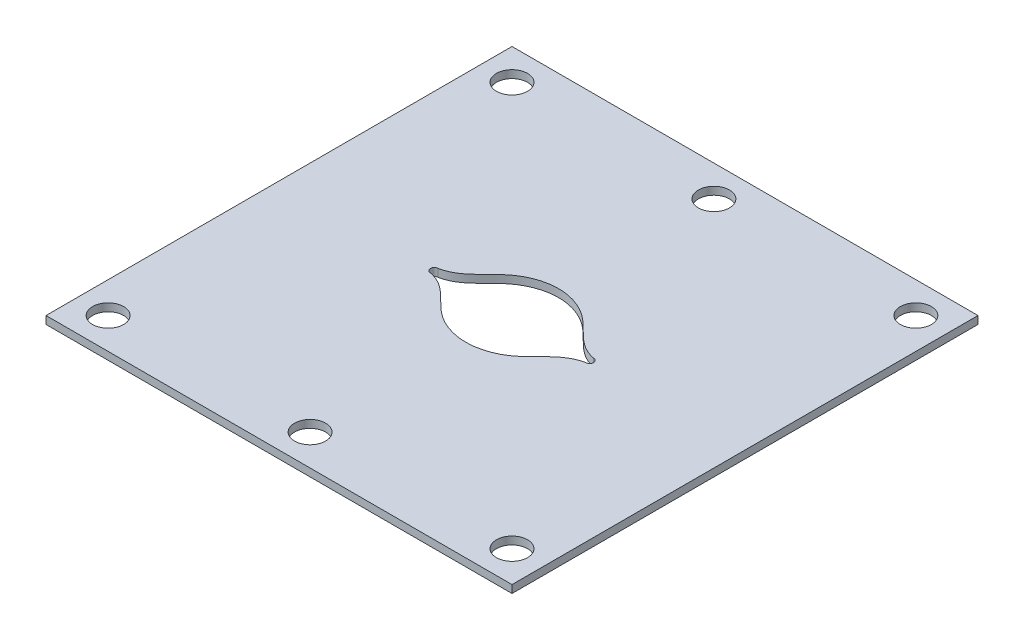
ISO-10303-21;
HEADER;
FILE_DESCRIPTION(('STEP AP214'),'2;1');
FILE_NAME('part.step','',(''),(''),'','','');
FILE_SCHEMA(('AUTOMOTIVE_DESIGN { 1 0 10303 214 1 1 1 1 }'));
ENDSEC;
DATA;
#1=APPLICATION_CONTEXT('core data for automotive mechanical design processes');
#2=APPLICATION_PROTOCOL_DEFINITION('international standard','automotive_design',2000,#1);
#3=PRODUCT_CONTEXT('',#1,'mechanical');
#4=PRODUCT('Part','Part','',(#3));
#5=PRODUCT_RELATED_PRODUCT_CATEGORY('part','',(#4));
#6=PRODUCT_DEFINITION_FORMATION('','',#4);
#7=PRODUCT_DEFINITION_CONTEXT('part definition',#1,'design');
#8=PRODUCT_DEFINITION('design','',#6,#7);
#9=PRODUCT_DEFINITION_SHAPE('','',#8);
#10=(LENGTH_UNIT() NAMED_UNIT(*) SI_UNIT(.MILLI.,.METRE.));
#11=(NAMED_UNIT(*) PLANE_ANGLE_UNIT() SI_UNIT($,.RADIAN.));
#12=(NAMED_UNIT(*) SI_UNIT($,.STERADIAN.) SOLID_ANGLE_UNIT());
#13=UNCERTAINTY_MEASURE_WITH_UNIT(LENGTH_MEASURE(1.E-05),#10,'distance_accuracy_value','');
#14=(GEOMETRIC_REPRESENTATION_CONTEXT(3) GLOBAL_UNCERTAINTY_ASSIGNED_CONTEXT((#13)) GLOBAL_UNIT_ASSIGNED_CONTEXT((#10,
#11,#12)) REPRESENTATION_CONTEXT('',''));
#15=CARTESIAN_POINT('',(0.,0.,0.));
#16=DIRECTION('',(0.,0.,1.));
#17=DIRECTION('',(1.,0.,0.));
#18=AXIS2_PLACEMENT_3D('',#15,#16,#17);
#19=CARTESIAN_POINT('',(-30.,1.,30.));
#20=DIRECTION('',(1.,0.,0.));
#21=DIRECTION('',(0.,0.,-1.));
#22=AXIS2_PLACEMENT_3D('',#19,#20,#21);
#23=PLANE('',#22);
#24=DIRECTION('',(0.,0.,1.));
#25=VECTOR('',#24,1.);
#26=CARTESIAN_POINT('',(-30.,0.,30.));
#27=LINE('',#26,#25);
#28=CARTESIAN_POINT('',(-30.,0.,-30.));
#29=VERTEX_POINT('',#28);
#30=CARTESIAN_POINT('',(-30.,0.,30.));
#31=VERTEX_POINT('',#30);
#32=EDGE_CURVE('E189',#29,#31,#27,.T.);
#33=ORIENTED_EDGE('',*,*,#32,.T.);
#34=DIRECTION('',(0.,-1.,0.));
#35=VECTOR('',#34,1.);
#36=CARTESIAN_POINT('',(-30.,1.,30.));
#37=LINE('',#36,#35);
#38=CARTESIAN_POINT('',(-30.,1.,30.));
#39=VERTEX_POINT('',#38);
#40=EDGE_CURVE('E218',#39,#31,#37,.T.);
#41=ORIENTED_EDGE('',*,*,#40,.F.);
#42=DIRECTION('',(0.,0.,1.));
#43=VECTOR('',#42,1.);
#44=CARTESIAN_POINT('',(-30.,1.,30.));
#45=LINE('',#44,#43);
#46=CARTESIAN_POINT('',(-30.,1.,-30.));
#47=VERTEX_POINT('',#46);
#48=EDGE_CURVE('E192',#47,#39,#45,.T.);
#49=ORIENTED_EDGE('',*,*,#48,.F.);
#50=DIRECTION('',(0.,-1.,0.));
#51=VECTOR('',#50,1.);
#52=CARTESIAN_POINT('',(-30.,1.,-30.));
#53=LINE('',#52,#51);
#54=EDGE_CURVE('E202',#47,#29,#53,.T.);
#55=ORIENTED_EDGE('',*,*,#54,.T.);
#56=EDGE_LOOP('',(#33,#41,#49,#55));
#57=FACE_BOUND('',#56,.T.);
#58=ADVANCED_FACE('F34',(#57),#23,.F.);
#59=CARTESIAN_POINT('',(30.,1.,30.));
#60=DIRECTION('',(0.,0.,-1.));
#61=DIRECTION('',(-1.,0.,0.));
#62=AXIS2_PLACEMENT_3D('',#59,#60,#61);
#63=PLANE('',#62);
#64=DIRECTION('',(1.,0.,0.));
#65=VECTOR('',#64,1.);
#66=CARTESIAN_POINT('',(30.,0.,30.));
#67=LINE('',#66,#65);
#68=CARTESIAN_POINT('',(30.,0.,30.));
#69=VERTEX_POINT('',#68);
#70=EDGE_CURVE('E205',#31,#69,#67,.T.);
#71=ORIENTED_EDGE('',*,*,#70,.T.);
#72=DIRECTION('',(0.,-1.,0.));
#73=VECTOR('',#72,1.);
#74=CARTESIAN_POINT('',(30.,1.,30.));
#75=LINE('',#74,#73);
#76=CARTESIAN_POINT('',(30.,1.,30.));
#77=VERTEX_POINT('',#76);
#78=EDGE_CURVE('E215',#77,#69,#75,.T.);
#79=ORIENTED_EDGE('',*,*,#78,.F.);
#80=DIRECTION('',(1.,0.,0.));
#81=VECTOR('',#80,1.);
#82=CARTESIAN_POINT('',(30.,1.,30.));
#83=LINE('',#82,#81);
#84=EDGE_CURVE('E195',#39,#77,#83,.T.);
#85=ORIENTED_EDGE('',*,*,#84,.F.);
#86=ORIENTED_EDGE('',*,*,#40,.T.);
#87=EDGE_LOOP('',(#71,#79,#85,#86));
#88=FACE_BOUND('',#87,.T.);
#89=ADVANCED_FACE('F234',(#88),#63,.F.);
#90=CARTESIAN_POINT('',(30.,1.,30.));
#91=DIRECTION('',(-1.,0.,0.));
#92=DIRECTION('',(0.,0.,1.));
#93=AXIS2_PLACEMENT_3D('',#90,#91,#92);
#94=PLANE('',#93);
#95=DIRECTION('',(0.,0.,-1.));
#96=VECTOR('',#95,1.);
#97=CARTESIAN_POINT('',(30.,0.,30.));
#98=LINE('',#97,#96);
#99=CARTESIAN_POINT('',(30.,0.,-30.));
#100=VERTEX_POINT('',#99);
#101=EDGE_CURVE('E207',#69,#100,#98,.T.);
#102=ORIENTED_EDGE('',*,*,#101,.T.);
#103=DIRECTION('',(0.,-1.,0.));
#104=VECTOR('',#103,1.);
#105=CARTESIAN_POINT('',(30.,1.,-30.));
#106=LINE('',#105,#104);
#107=CARTESIAN_POINT('',(30.,1.,-30.));
#108=VERTEX_POINT('',#107);
#109=EDGE_CURVE('E212',#108,#100,#106,.T.);
#110=ORIENTED_EDGE('',*,*,#109,.F.);
#111=DIRECTION('',(0.,0.,-1.));
#112=VECTOR('',#111,1.);
#113=CARTESIAN_POINT('',(30.,1.,30.));
#114=LINE('',#113,#112);
#115=EDGE_CURVE('E198',#77,#108,#114,.T.);
#116=ORIENTED_EDGE('',*,*,#115,.F.);
#117=ORIENTED_EDGE('',*,*,#78,.T.);
#118=EDGE_LOOP('',(#102,#110,#116,#117));
#119=FACE_BOUND('',#118,.T.);
#120=ADVANCED_FACE('F239',(#119),#94,.F.);
#121=CARTESIAN_POINT('',(30.,1.,-30.));
#122=DIRECTION('',(0.,0.,1.));
#123=DIRECTION('',(1.,0.,0.));
#124=AXIS2_PLACEMENT_3D('',#121,#122,#123);
#125=PLANE('',#124);
#126=DIRECTION('',(-1.,0.,0.));
#127=VECTOR('',#126,1.);
#128=CARTESIAN_POINT('',(30.,0.,-30.));
#129=LINE('',#128,#127);
#130=EDGE_CURVE('E196',#100,#29,#129,.T.);
#131=ORIENTED_EDGE('',*,*,#130,.T.);
#132=ORIENTED_EDGE('',*,*,#54,.F.);
#133=DIRECTION('',(-1.,0.,0.));
#134=VECTOR('',#133,1.);
#135=CARTESIAN_POINT('',(30.,1.,-30.));
#136=LINE('',#135,#134);
#137=EDGE_CURVE('E200',#108,#47,#136,.T.);
#138=ORIENTED_EDGE('',*,*,#137,.F.);
#139=ORIENTED_EDGE('',*,*,#109,.T.);
#140=EDGE_LOOP('',(#131,#132,#138,#139));
#141=FACE_BOUND('',#140,.T.);
#142=ADVANCED_FACE('F254',(#141),#125,.F.);
#143=CARTESIAN_POINT('',(0.,1.,0.));
#144=DIRECTION('',(0.,1.,0.));
#145=DIRECTION('',(0.,0.,1.));
#146=AXIS2_PLACEMENT_3D('',#143,#144,#145);
#147=PLANE('',#146);
#148=CARTESIAN_POINT('',(-10.,1.,0.5));
#149=CARTESIAN_POINT('',(-7.53961415841813,1.,0.960866700631798));
#150=CARTESIAN_POINT('',(-5.55145115373581,1.,4.66287064469579));
#151=CARTESIAN_POINT('',(0.,1.,6.48271716056343));
#152=CARTESIAN_POINT('',(5.55145115373581,1.,4.66287064469579));
#153=CARTESIAN_POINT('',(7.53961415841813,1.,0.960866700631792));
#154=CARTESIAN_POINT('',(10.,1.,0.500000000000001));
#155=B_SPLINE_CURVE_WITH_KNOTS('',3,(#148,#149,#150,#151,#152,#153,#154),.UNSPECIFIED.,.F.,.F.,
(4,1,1,1,4),(0.,0.296041392949198,0.5,0.703958607050802,1.),.UNSPECIFIED.);
#156=CARTESIAN_POINT('',(-10.,1.,0.500000000000001));
#157=VERTEX_POINT('',#156);
#158=CARTESIAN_POINT('',(10.,1.,0.500000000000001));
#159=VERTEX_POINT('',#158);
#160=EDGE_CURVE('E114',#157,#159,#155,.T.);
#161=ORIENTED_EDGE('',*,*,#160,.F.);
#162=CARTESIAN_POINT('',(-10.,1.,0.));
#163=DIRECTION('',(0.,1.,0.));
#164=DIRECTION('',(0.,0.,1.));
#165=AXIS2_PLACEMENT_3D('',#162,#163,#164);
#166=CIRCLE('',#165,0.500000000000001);
#167=CARTESIAN_POINT('',(-10.,1.,-0.500000000000001));
#168=VERTEX_POINT('',#167);
#169=EDGE_CURVE('E119',#168,#157,#166,.T.);
#170=ORIENTED_EDGE('',*,*,#169,.F.);
#171=CARTESIAN_POINT('',(10.,1.,-0.500000000000001));
#172=CARTESIAN_POINT('',(7.5418560903601,1.,-0.971550621999899));
#173=CARTESIAN_POINT('',(5.54199885024011,1.,-4.63362119343008));
#174=CARTESIAN_POINT('',(0.,1.,-6.55833807754496));
#175=CARTESIAN_POINT('',(-5.5419988502401,1.,-4.63362119343008));
#176=CARTESIAN_POINT('',(-7.5418560903601,1.,-0.971550621999899));
#177=CARTESIAN_POINT('',(-10.,1.,-0.5));
#178=B_SPLINE_CURVE_WITH_KNOTS('',3,(#171,#172,#173,#174,#175,#176,#177),.UNSPECIFIED.,.F.,.F.,
(4,1,1,1,4),(0.,0.295686937304533,0.5,0.704313062695467,1.),.UNSPECIFIED.);
#179=CARTESIAN_POINT('',(10.,1.,-0.500000000000001));
#180=VERTEX_POINT('',#179);
#181=EDGE_CURVE('E48',#180,#168,#178,.T.);
#182=ORIENTED_EDGE('',*,*,#181,.F.);
#183=CARTESIAN_POINT('',(10.,1.,0.));
#184=DIRECTION('',(0.,1.,0.));
#185=DIRECTION('',(0.,0.,1.));
#186=AXIS2_PLACEMENT_3D('',#183,#184,#185);
#187=CIRCLE('',#186,0.500000000000001);
#188=EDGE_CURVE('E102',#159,#180,#187,.T.);
#189=ORIENTED_EDGE('',*,*,#188,.F.);
#190=EDGE_LOOP('',(#161,#170,#182,#189));
#191=FACE_BOUND('',#190,.T.);
#192=CARTESIAN_POINT('',(-26.,1.,26.));
#193=DIRECTION('',(0.,1.,0.));
#194=DIRECTION('',(0.,0.,1.));
#195=AXIS2_PLACEMENT_3D('',#192,#193,#194);
#196=CIRCLE('',#195,2.);
#197=CARTESIAN_POINT('',(-26.,1.,28.));
#198=VERTEX_POINT('',#197);
#199=EDGE_CURVE('E154',#198,#198,#196,.T.);
#200=ORIENTED_EDGE('',*,*,#199,.F.);
#201=EDGE_LOOP('',(#200));
#202=FACE_BOUND('',#201,.T.);
#203=CARTESIAN_POINT('',(0.,1.,26.));
#204=DIRECTION('',(0.,1.,0.));
#205=DIRECTION('',(0.,0.,1.));
#206=AXIS2_PLACEMENT_3D('',#203,#204,#205);
#207=CIRCLE('',#206,2.);
#208=CARTESIAN_POINT('',(0.,1.,28.));
#209=VERTEX_POINT('',#208);
#210=EDGE_CURVE('E159',#209,#209,#207,.T.);
#211=ORIENTED_EDGE('',*,*,#210,.F.);
#212=EDGE_LOOP('',(#211));
#213=FACE_BOUND('',#212,.T.);
#214=CARTESIAN_POINT('',(26.,1.,26.));
#215=DIRECTION('',(0.,1.,0.));
#216=DIRECTION('',(0.,0.,1.));
#217=AXIS2_PLACEMENT_3D('',#214,#215,#216);
#218=CIRCLE('',#217,2.);
#219=CARTESIAN_POINT('',(26.,1.,28.));
#220=VERTEX_POINT('',#219);
#221=EDGE_CURVE('E165',#220,#220,#218,.T.);
#222=ORIENTED_EDGE('',*,*,#221,.F.);
#223=EDGE_LOOP('',(#222));
#224=FACE_BOUND('',#223,.T.);
#225=CARTESIAN_POINT('',(26.,1.,-26.));
#226=DIRECTION('',(0.,1.,0.));
#227=DIRECTION('',(0.,0.,1.));
#228=AXIS2_PLACEMENT_3D('',#225,#226,#227);
#229=CIRCLE('',#228,2.);
#230=CARTESIAN_POINT('',(26.,1.,-24.));
#231=VERTEX_POINT('',#230);
#232=EDGE_CURVE('E171',#231,#231,#229,.T.);
#233=ORIENTED_EDGE('',*,*,#232,.F.);
#234=EDGE_LOOP('',(#233));
#235=FACE_BOUND('',#234,.T.);
#236=CARTESIAN_POINT('',(0.,1.,-26.));
#237=DIRECTION('',(0.,1.,0.));
#238=DIRECTION('',(0.,0.,1.));
#239=AXIS2_PLACEMENT_3D('',#236,#237,#238);
#240=CIRCLE('',#239,2.);
#241=CARTESIAN_POINT('',(0.,1.,-24.));
#242=VERTEX_POINT('',#241);
#243=EDGE_CURVE('E177',#242,#242,#240,.T.);
#244=ORIENTED_EDGE('',*,*,#243,.F.);
#245=EDGE_LOOP('',(#244));
#246=FACE_BOUND('',#245,.T.);
#247=CARTESIAN_POINT('',(-26.,1.,-26.));
#248=DIRECTION('',(0.,1.,0.));
#249=DIRECTION('',(0.,0.,1.));
#250=AXIS2_PLACEMENT_3D('',#247,#248,#249);
#251=CIRCLE('',#250,2.);
#252=CARTESIAN_POINT('',(-26.,1.,-24.));
#253=VERTEX_POINT('',#252);
#254=EDGE_CURVE('E183',#253,#253,#251,.T.);
#255=ORIENTED_EDGE('',*,*,#254,.F.);
#256=EDGE_LOOP('',(#255));
#257=FACE_BOUND('',#256,.T.);
#258=ORIENTED_EDGE('',*,*,#48,.T.);
#259=ORIENTED_EDGE('',*,*,#84,.T.);
#260=ORIENTED_EDGE('',*,*,#115,.T.);
#261=ORIENTED_EDGE('',*,*,#137,.T.);
#262=EDGE_LOOP('',(#258,#259,#260,#261));
#263=FACE_BOUND('',#262,.T.);
#264=ADVANCED_FACE('F117',(#191,#202,#213,#224,#235,#246,#257,#263),#147,.T.);
#265=CARTESIAN_POINT('',(0.,0.,0.));
#266=DIRECTION('',(0.,1.,0.));
#267=DIRECTION('',(0.,0.,1.));
#268=AXIS2_PLACEMENT_3D('',#265,#266,#267);
#269=PLANE('',#268);
#270=CARTESIAN_POINT('',(-10.,0.,0.));
#271=DIRECTION('',(0.,1.,0.));
#272=DIRECTION('',(0.,0.,1.));
#273=AXIS2_PLACEMENT_3D('',#270,#271,#272);
#274=CIRCLE('',#273,0.500000000000001);
#275=CARTESIAN_POINT('',(-10.,0.,-0.5));
#276=VERTEX_POINT('',#275);
#277=CARTESIAN_POINT('',(-10.,0.,0.500000000000001));
#278=VERTEX_POINT('',#277);
#279=EDGE_CURVE('E56',#276,#278,#274,.T.);
#280=ORIENTED_EDGE('',*,*,#279,.T.);
#281=CARTESIAN_POINT('',(-10.,0.,0.5));
#282=CARTESIAN_POINT('',(-7.53961415841813,0.,0.960866700631798));
#283=CARTESIAN_POINT('',(-5.55145115373581,0.,4.66287064469579));
#284=CARTESIAN_POINT('',(0.,0.,6.48271716056343));
#285=CARTESIAN_POINT('',(5.55145115373581,0.,4.66287064469579));
#286=CARTESIAN_POINT('',(7.53961415841813,0.,0.960866700631792));
#287=CARTESIAN_POINT('',(10.,0.,0.500000000000001));
#288=B_SPLINE_CURVE_WITH_KNOTS('',3,(#281,#282,#283,#284,#285,#286,#287),.UNSPECIFIED.,.F.,.F.,
(4,1,1,1,4),(0.,0.296041392949198,0.5,0.703958607050802,1.),.UNSPECIFIED.);
#289=CARTESIAN_POINT('',(10.,0.,0.500000000000001));
#290=VERTEX_POINT('',#289);
#291=EDGE_CURVE('E142',#278,#290,#288,.T.);
#292=ORIENTED_EDGE('',*,*,#291,.T.);
#293=CARTESIAN_POINT('',(10.,0.,0.));
#294=DIRECTION('',(0.,1.,0.));
#295=DIRECTION('',(0.,0.,1.));
#296=AXIS2_PLACEMENT_3D('',#293,#294,#295);
#297=CIRCLE('',#296,0.500000000000001);
#298=CARTESIAN_POINT('',(10.,0.,-0.500000000000001));
#299=VERTEX_POINT('',#298);
#300=EDGE_CURVE('E109',#290,#299,#297,.T.);
#301=ORIENTED_EDGE('',*,*,#300,.T.);
#302=CARTESIAN_POINT('',(10.,0.,-0.500000000000001));
#303=CARTESIAN_POINT('',(7.5418560903601,0.,-0.971550621999899));
#304=CARTESIAN_POINT('',(5.54199885024011,0.,-4.63362119343008));
#305=CARTESIAN_POINT('',(0.,0.,-6.55833807754496));
#306=CARTESIAN_POINT('',(-5.5419988502401,0.,-4.63362119343008));
#307=CARTESIAN_POINT('',(-7.5418560903601,0.,-0.971550621999899));
#308=CARTESIAN_POINT('',(-10.,0.,-0.5));
#309=B_SPLINE_CURVE_WITH_KNOTS('',3,(#302,#303,#304,#305,#306,#307,#308),.UNSPECIFIED.,.F.,.F.,
(4,1,1,1,4),(0.,0.295686937304533,0.5,0.704313062695467,1.),.UNSPECIFIED.);
#310=EDGE_CURVE('E113',#299,#276,#309,.T.);
#311=ORIENTED_EDGE('',*,*,#310,.T.);
#312=EDGE_LOOP('',(#280,#292,#301,#311));
#313=FACE_BOUND('',#312,.T.);
#314=CARTESIAN_POINT('',(-26.,0.,26.));
#315=DIRECTION('',(0.,1.,0.));
#316=DIRECTION('',(0.,0.,1.));
#317=AXIS2_PLACEMENT_3D('',#314,#315,#316);
#318=CIRCLE('',#317,2.);
#319=CARTESIAN_POINT('',(-26.,0.,28.));
#320=VERTEX_POINT('',#319);
#321=EDGE_CURVE('E156',#320,#320,#318,.T.);
#322=ORIENTED_EDGE('',*,*,#321,.T.);
#323=EDGE_LOOP('',(#322));
#324=FACE_BOUND('',#323,.T.);
#325=CARTESIAN_POINT('',(0.,0.,26.));
#326=DIRECTION('',(0.,1.,0.));
#327=DIRECTION('',(0.,0.,1.));
#328=AXIS2_PLACEMENT_3D('',#325,#326,#327);
#329=CIRCLE('',#328,2.);
#330=CARTESIAN_POINT('',(0.,0.,28.));
#331=VERTEX_POINT('',#330);
#332=EDGE_CURVE('E162',#331,#331,#329,.T.);
#333=ORIENTED_EDGE('',*,*,#332,.T.);
#334=EDGE_LOOP('',(#333));
#335=FACE_BOUND('',#334,.T.);
#336=CARTESIAN_POINT('',(26.,0.,26.));
#337=DIRECTION('',(0.,1.,0.));
#338=DIRECTION('',(0.,0.,1.));
#339=AXIS2_PLACEMENT_3D('',#336,#337,#338);
#340=CIRCLE('',#339,2.);
#341=CARTESIAN_POINT('',(26.,0.,28.));
#342=VERTEX_POINT('',#341);
#343=EDGE_CURVE('E168',#342,#342,#340,.T.);
#344=ORIENTED_EDGE('',*,*,#343,.T.);
#345=EDGE_LOOP('',(#344));
#346=FACE_BOUND('',#345,.T.);
#347=CARTESIAN_POINT('',(26.,0.,-26.));
#348=DIRECTION('',(0.,1.,0.));
#349=DIRECTION('',(0.,0.,1.));
#350=AXIS2_PLACEMENT_3D('',#347,#348,#349);
#351=CIRCLE('',#350,2.);
#352=CARTESIAN_POINT('',(26.,0.,-24.));
#353=VERTEX_POINT('',#352);
#354=EDGE_CURVE('E174',#353,#353,#351,.T.);
#355=ORIENTED_EDGE('',*,*,#354,.T.);
#356=EDGE_LOOP('',(#355));
#357=FACE_BOUND('',#356,.T.);
#358=CARTESIAN_POINT('',(0.,0.,-26.));
#359=DIRECTION('',(0.,1.,0.));
#360=DIRECTION('',(0.,0.,1.));
#361=AXIS2_PLACEMENT_3D('',#358,#359,#360);
#362=CIRCLE('',#361,2.);
#363=CARTESIAN_POINT('',(0.,0.,-24.));
#364=VERTEX_POINT('',#363);
#365=EDGE_CURVE('E180',#364,#364,#362,.T.);
#366=ORIENTED_EDGE('',*,*,#365,.T.);
#367=EDGE_LOOP('',(#366));
#368=FACE_BOUND('',#367,.T.);
#369=CARTESIAN_POINT('',(-26.,0.,-26.));
#370=DIRECTION('',(0.,1.,0.));
#371=DIRECTION('',(0.,0.,1.));
#372=AXIS2_PLACEMENT_3D('',#369,#370,#371);
#373=CIRCLE('',#372,2.);
#374=CARTESIAN_POINT('',(-26.,0.,-24.));
#375=VERTEX_POINT('',#374);
#376=EDGE_CURVE('E186',#375,#375,#373,.T.);
#377=ORIENTED_EDGE('',*,*,#376,.T.);
#378=EDGE_LOOP('',(#377));
#379=FACE_BOUND('',#378,.T.);
#380=ORIENTED_EDGE('',*,*,#32,.F.);
#381=ORIENTED_EDGE('',*,*,#130,.F.);
#382=ORIENTED_EDGE('',*,*,#101,.F.);
#383=ORIENTED_EDGE('',*,*,#70,.F.);
#384=EDGE_LOOP('',(#380,#381,#382,#383));
#385=FACE_BOUND('',#384,.T.);
#386=ADVANCED_FACE('F223',(#313,#324,#335,#346,#357,#368,#379,#385),#269,.F.);
#387=CARTESIAN_POINT('',(-26.,0.,-26.));
#388=DIRECTION('',(0.,1.,0.));
#389=DIRECTION('',(0.,0.,1.));
#390=AXIS2_PLACEMENT_3D('',#387,#388,#389);
#391=CYLINDRICAL_SURFACE('',#390,2.);
#392=ORIENTED_EDGE('',*,*,#376,.F.);
#393=EDGE_LOOP('',(#392));
#394=FACE_BOUND('',#393,.T.);
#395=ORIENTED_EDGE('',*,*,#254,.T.);
#396=EDGE_LOOP('',(#395));
#397=FACE_BOUND('',#396,.T.);
#398=ADVANCED_FACE('F265',(#394,#397),#391,.F.);
#399=CARTESIAN_POINT('',(0.,0.,-26.));
#400=DIRECTION('',(0.,1.,0.));
#401=DIRECTION('',(0.,0.,1.));
#402=AXIS2_PLACEMENT_3D('',#399,#400,#401);
#403=CYLINDRICAL_SURFACE('',#402,2.);
#404=ORIENTED_EDGE('',*,*,#365,.F.);
#405=EDGE_LOOP('',(#404));
#406=FACE_BOUND('',#405,.T.);
#407=ORIENTED_EDGE('',*,*,#243,.T.);
#408=EDGE_LOOP('',(#407));
#409=FACE_BOUND('',#408,.T.);
#410=ADVANCED_FACE('F270',(#406,#409),#403,.F.);
#411=CARTESIAN_POINT('',(26.,0.,-26.));
#412=DIRECTION('',(0.,1.,0.));
#413=DIRECTION('',(0.,0.,1.));
#414=AXIS2_PLACEMENT_3D('',#411,#412,#413);
#415=CYLINDRICAL_SURFACE('',#414,2.);
#416=ORIENTED_EDGE('',*,*,#354,.F.);
#417=EDGE_LOOP('',(#416));
#418=FACE_BOUND('',#417,.T.);
#419=ORIENTED_EDGE('',*,*,#232,.T.);
#420=EDGE_LOOP('',(#419));
#421=FACE_BOUND('',#420,.T.);
#422=ADVANCED_FACE('F274',(#418,#421),#415,.F.);
#423=CARTESIAN_POINT('',(26.,0.,26.));
#424=DIRECTION('',(0.,1.,0.));
#425=DIRECTION('',(0.,0.,1.));
#426=AXIS2_PLACEMENT_3D('',#423,#424,#425);
#427=CYLINDRICAL_SURFACE('',#426,2.);
#428=ORIENTED_EDGE('',*,*,#343,.F.);
#429=EDGE_LOOP('',(#428));
#430=FACE_BOUND('',#429,.T.);
#431=ORIENTED_EDGE('',*,*,#221,.T.);
#432=EDGE_LOOP('',(#431));
#433=FACE_BOUND('',#432,.T.);
#434=ADVANCED_FACE('F278',(#430,#433),#427,.F.);
#435=CARTESIAN_POINT('',(0.,0.,26.));
#436=DIRECTION('',(0.,1.,0.));
#437=DIRECTION('',(0.,0.,1.));
#438=AXIS2_PLACEMENT_3D('',#435,#436,#437);
#439=CYLINDRICAL_SURFACE('',#438,2.);
#440=ORIENTED_EDGE('',*,*,#332,.F.);
#441=EDGE_LOOP('',(#440));
#442=FACE_BOUND('',#441,.T.);
#443=ORIENTED_EDGE('',*,*,#210,.T.);
#444=EDGE_LOOP('',(#443));
#445=FACE_BOUND('',#444,.T.);
#446=ADVANCED_FACE('F282',(#442,#445),#439,.F.);
#447=CARTESIAN_POINT('',(-26.,0.,26.));
#448=DIRECTION('',(0.,1.,0.));
#449=DIRECTION('',(0.,0.,1.));
#450=AXIS2_PLACEMENT_3D('',#447,#448,#449);
#451=CYLINDRICAL_SURFACE('',#450,2.);
#452=ORIENTED_EDGE('',*,*,#321,.F.);
#453=EDGE_LOOP('',(#452));
#454=FACE_BOUND('',#453,.T.);
#455=ORIENTED_EDGE('',*,*,#199,.T.);
#456=EDGE_LOOP('',(#455));
#457=FACE_BOUND('',#456,.T.);
#458=ADVANCED_FACE('F286',(#454,#457),#451,.F.);
#459=CARTESIAN_POINT('',(10.,0.,0.));
#460=DIRECTION('',(0.,1.,0.));
#461=DIRECTION('',(0.,0.,1.));
#462=AXIS2_PLACEMENT_3D('',#459,#460,#461);
#463=CYLINDRICAL_SURFACE('',#462,0.500000000000001);
#464=DIRECTION('',(0.,1.,0.));
#465=VECTOR('',#464,1.);
#466=CARTESIAN_POINT('',(10.,-9.,-0.500000000000001));
#467=LINE('',#466,#465);
#468=EDGE_CURVE('E105',#299,#180,#467,.T.);
#469=ORIENTED_EDGE('',*,*,#468,.F.);
#470=ORIENTED_EDGE('',*,*,#300,.F.);
#471=DIRECTION('',(0.,1.,0.));
#472=VECTOR('',#471,1.);
#473=CARTESIAN_POINT('',(10.,-9.,0.500000000000001));
#474=LINE('',#473,#472);
#475=EDGE_CURVE('E106',#290,#159,#474,.T.);
#476=ORIENTED_EDGE('',*,*,#475,.T.);
#477=ORIENTED_EDGE('',*,*,#188,.T.);
#478=EDGE_LOOP('',(#469,#470,#476,#477));
#479=FACE_BOUND('',#478,.T.);
#480=ADVANCED_FACE('F103',(#479),#463,.F.);
#481=CARTESIAN_POINT('',(-10.,0.,0.));
#482=DIRECTION('',(0.,1.,0.));
#483=DIRECTION('',(0.,0.,1.));
#484=AXIS2_PLACEMENT_3D('',#481,#482,#483);
#485=CYLINDRICAL_SURFACE('',#484,0.500000000000001);
#486=DIRECTION('',(0.,1.,0.));
#487=VECTOR('',#486,1.);
#488=CARTESIAN_POINT('',(-10.,-9.,0.500000000000001));
#489=LINE('',#488,#487);
#490=EDGE_CURVE('E11',#157,#278,#489,.F.);
#491=ORIENTED_EDGE('',*,*,#490,.T.);
#492=ORIENTED_EDGE('',*,*,#279,.F.);
#493=DIRECTION('',(0.,1.,0.));
#494=VECTOR('',#493,1.);
#495=CARTESIAN_POINT('',(-10.,-9.,-0.5));
#496=LINE('',#495,#494);
#497=EDGE_CURVE('E41',#276,#168,#496,.T.);
#498=ORIENTED_EDGE('',*,*,#497,.T.);
#499=ORIENTED_EDGE('',*,*,#169,.T.);
#500=EDGE_LOOP('',(#491,#492,#498,#499));
#501=FACE_BOUND('',#500,.T.);
#502=ADVANCED_FACE('F221',(#501),#485,.F.);
#503=CARTESIAN_POINT('',(10.,-9.,-0.500000000000001));
#504=CARTESIAN_POINT('',(7.5418560903601,-9.,-0.971550621999899));
#505=CARTESIAN_POINT('',(5.54199885024011,-9.,-4.63362119343008));
#506=CARTESIAN_POINT('',(0.,-9.,-6.55833807754496));
#507=CARTESIAN_POINT('',(-5.5419988502401,-9.,-4.63362119343008));
#508=CARTESIAN_POINT('',(-7.5418560903601,-9.,-0.971550621999899));
#509=CARTESIAN_POINT('',(-10.,-9.,-0.5));
#510=B_SPLINE_CURVE_WITH_KNOTS('',3,(#503,#504,#505,#506,#507,#508,#509),.UNSPECIFIED.,.F.,.F.,
(4,1,1,1,4),(0.,0.295686937304533,0.5,0.704313062695467,1.),.UNSPECIFIED.);
#511=DIRECTION('',(0.,1.,0.));
#512=VECTOR('',#511,1.);
#513=SURFACE_OF_LINEAR_EXTRUSION('',#510,#512);
#514=ORIENTED_EDGE('',*,*,#468,.T.);
#515=ORIENTED_EDGE('',*,*,#181,.T.);
#516=ORIENTED_EDGE('',*,*,#497,.F.);
#517=ORIENTED_EDGE('',*,*,#310,.F.);
#518=EDGE_LOOP('',(#514,#515,#516,#517));
#519=FACE_BOUND('',#518,.T.);
#520=ADVANCED_FACE('F112',(#519),#513,.F.);
#521=CARTESIAN_POINT('',(-10.,-9.,0.5));
#522=CARTESIAN_POINT('',(-7.53961415841813,-9.,0.960866700631798));
#523=CARTESIAN_POINT('',(-5.55145115373581,-9.,4.66287064469579));
#524=CARTESIAN_POINT('',(0.,-9.,6.48271716056343));
#525=CARTESIAN_POINT('',(5.55145115373581,-9.,4.66287064469579));
#526=CARTESIAN_POINT('',(7.53961415841813,-9.,0.960866700631792));
#527=CARTESIAN_POINT('',(10.,-9.,0.500000000000001));
#528=B_SPLINE_CURVE_WITH_KNOTS('',3,(#521,#522,#523,#524,#525,#526,#527),.UNSPECIFIED.,.F.,.F.,
(4,1,1,1,4),(0.,0.296041392949198,0.5,0.703958607050802,1.),.UNSPECIFIED.);
#529=DIRECTION('',(0.,1.,0.));
#530=VECTOR('',#529,1.);
#531=SURFACE_OF_LINEAR_EXTRUSION('',#528,#530);
#532=ORIENTED_EDGE('',*,*,#490,.F.);
#533=ORIENTED_EDGE('',*,*,#160,.T.);
#534=ORIENTED_EDGE('',*,*,#475,.F.);
#535=ORIENTED_EDGE('',*,*,#291,.F.);
#536=EDGE_LOOP('',(#532,#533,#534,#535));
#537=FACE_BOUND('',#536,.T.);
#538=ADVANCED_FACE('F226',(#537),#531,.F.);
#539=CLOSED_SHELL('',(#58,#89,#120,#142,#264,#386,#398,#410,#422,#434,#446,#458,#480,#502,#520,#538));
#540=MANIFOLD_SOLID_BREP('B2',#539);
#541=ADVANCED_BREP_SHAPE_REPRESENTATION('',(#18,#540),#14);
#542=SHAPE_DEFINITION_REPRESENTATION(#9,#541);
ENDSEC;
END-ISO-10303-21;
